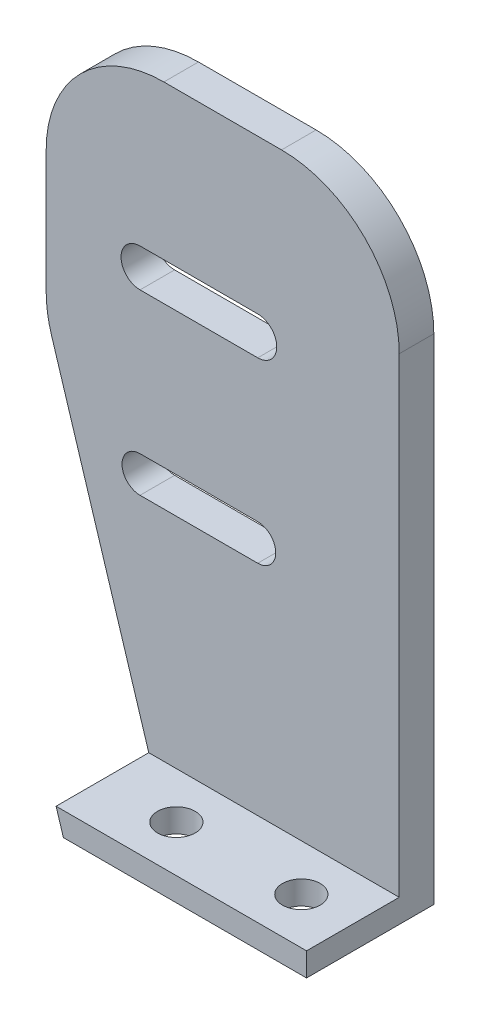
ISO-10303-21;
HEADER;
FILE_DESCRIPTION(('STEP AP214'),'2;1');
FILE_NAME('part.step','',(''),(''),'','','');
FILE_SCHEMA(('AUTOMOTIVE_DESIGN { 1 0 10303 214 1 1 1 1 }'));
ENDSEC;
DATA;
#1=APPLICATION_CONTEXT('core data for automotive mechanical design processes');
#2=APPLICATION_PROTOCOL_DEFINITION('international standard','automotive_design',2000,#1);
#3=PRODUCT_CONTEXT('',#1,'mechanical');
#4=PRODUCT('Part','Part','',(#3));
#5=PRODUCT_RELATED_PRODUCT_CATEGORY('part','',(#4));
#6=PRODUCT_DEFINITION_FORMATION('','',#4);
#7=PRODUCT_DEFINITION_CONTEXT('part definition',#1,'design');
#8=PRODUCT_DEFINITION('design','',#6,#7);
#9=PRODUCT_DEFINITION_SHAPE('','',#8);
#10=(LENGTH_UNIT() NAMED_UNIT(*) SI_UNIT(.MILLI.,.METRE.));
#11=(NAMED_UNIT(*) PLANE_ANGLE_UNIT() SI_UNIT($,.RADIAN.));
#12=(NAMED_UNIT(*) SI_UNIT($,.STERADIAN.) SOLID_ANGLE_UNIT());
#13=UNCERTAINTY_MEASURE_WITH_UNIT(LENGTH_MEASURE(1.E-05),#10,'distance_accuracy_value','');
#14=(GEOMETRIC_REPRESENTATION_CONTEXT(3) GLOBAL_UNCERTAINTY_ASSIGNED_CONTEXT((#13)) GLOBAL_UNIT_ASSIGNED_CONTEXT((#10,
#11,#12)) REPRESENTATION_CONTEXT('',''));
#15=CARTESIAN_POINT('',(0.,0.,0.));
#16=DIRECTION('',(0.,0.,1.));
#17=DIRECTION('',(1.,0.,0.));
#18=AXIS2_PLACEMENT_3D('',#15,#16,#17);
#19=CARTESIAN_POINT('',(15.,2.,-3.93700787401574));
#20=DIRECTION('',(-1.,0.,0.));
#21=DIRECTION('',(0.,0.,1.));
#22=AXIS2_PLACEMENT_3D('',#19,#20,#21);
#23=PLANE('',#22);
#24=DIRECTION('',(0.,-1.,0.));
#25=VECTOR('',#24,1.);
#26=CARTESIAN_POINT('',(15.,2.,-3.93700787401574));
#27=LINE('',#26,#25);
#28=CARTESIAN_POINT('',(15.,42.,-3.93700787401574));
#29=VERTEX_POINT('',#28);
#30=CARTESIAN_POINT('',(15.,0.,-3.93700787401574));
#31=VERTEX_POINT('',#30);
#32=EDGE_CURVE('E199',#29,#31,#27,.T.);
#33=ORIENTED_EDGE('',*,*,#32,.F.);
#34=DIRECTION('',(0.,0.,-1.));
#35=VECTOR('',#34,1.);
#36=CARTESIAN_POINT('',(15.,42.,-3.93700787401574));
#37=LINE('',#36,#35);
#38=CARTESIAN_POINT('',(15.,42.,-0.998677689997507));
#39=VERTEX_POINT('',#38);
#40=EDGE_CURVE('E11',#29,#39,#37,.F.);
#41=ORIENTED_EDGE('',*,*,#40,.T.);
#42=DIRECTION('',(0.,-1.,0.));
#43=VECTOR('',#42,1.);
#44=CARTESIAN_POINT('',(15.,52.,-0.998677689997507));
#45=LINE('',#44,#43);
#46=CARTESIAN_POINT('',(15.,2.,-0.998677689997507));
#47=VERTEX_POINT('',#46);
#48=EDGE_CURVE('E254',#39,#47,#45,.T.);
#49=ORIENTED_EDGE('',*,*,#48,.T.);
#50=DIRECTION('',(0.,0.,-1.));
#51=VECTOR('',#50,1.);
#52=CARTESIAN_POINT('',(15.,2.,-3.93700787401574));
#53=LINE('',#52,#51);
#54=CARTESIAN_POINT('',(15.,2.,6.87756826049224));
#55=VERTEX_POINT('',#54);
#56=EDGE_CURVE('E186',#55,#47,#53,.T.);
#57=ORIENTED_EDGE('',*,*,#56,.F.);
#58=DIRECTION('',(0.,-1.,0.));
#59=VECTOR('',#58,1.);
#60=CARTESIAN_POINT('',(15.,2.,6.87756826049224));
#61=LINE('',#60,#59);
#62=CARTESIAN_POINT('',(15.,0.,6.87756826049224));
#63=VERTEX_POINT('',#62);
#64=EDGE_CURVE('E194',#55,#63,#61,.T.);
#65=ORIENTED_EDGE('',*,*,#64,.T.);
#66=DIRECTION('',(0.,0.,-1.));
#67=VECTOR('',#66,1.);
#68=CARTESIAN_POINT('',(15.,0.,-3.93700787401574));
#69=LINE('',#68,#67);
#70=EDGE_CURVE('E185',#63,#31,#69,.T.);
#71=ORIENTED_EDGE('',*,*,#70,.T.);
#72=EDGE_LOOP('',(#33,#41,#49,#57,#65,#71));
#73=FACE_BOUND('',#72,.T.);
#74=ADVANCED_FACE('F33',(#73),#23,.F.);
#75=CARTESIAN_POINT('',(-15.,2.,-3.93700787401574));
#76=DIRECTION('',(0.,0.,1.));
#77=DIRECTION('',(1.,0.,0.));
#78=AXIS2_PLACEMENT_3D('',#75,#76,#77);
#79=PLANE('',#78);
#80=DIRECTION('',(-1.,0.,0.));
#81=VECTOR('',#80,1.);
#82=CARTESIAN_POINT('',(2.97561329115718,35.6877843306771,-3.93700787401574));
#83=LINE('',#82,#81);
#84=CARTESIAN_POINT('',(2.97561329115718,35.6877843306771,-3.93700787401574));
#85=VERTEX_POINT('',#84);
#86=CARTESIAN_POINT('',(-7.02438670884283,35.6877843306771,-3.93700787401574));
#87=VERTEX_POINT('',#86);
#88=EDGE_CURVE('E295',#85,#87,#83,.T.);
#89=ORIENTED_EDGE('',*,*,#88,.F.);
#90=CARTESIAN_POINT('',(2.97561329115718,37.3029416845353,-3.93700787401574));
#91=DIRECTION('',(0.,0.,-1.));
#92=DIRECTION('',(-1.,0.,0.));
#93=AXIS2_PLACEMENT_3D('',#90,#91,#92);
#94=CIRCLE('',#93,1.61515735385817);
#95=CARTESIAN_POINT('',(2.97561329115718,38.9180990383934,-3.93700787401574));
#96=VERTEX_POINT('',#95);
#97=EDGE_CURVE('E293',#96,#85,#94,.T.);
#98=ORIENTED_EDGE('',*,*,#97,.F.);
#99=DIRECTION('',(1.,0.,0.));
#100=VECTOR('',#99,1.);
#101=CARTESIAN_POINT('',(2.97561329115718,38.9180990383934,-3.93700787401574));
#102=LINE('',#101,#100);
#103=CARTESIAN_POINT('',(-7.02438670884283,38.9180990383934,-3.93700787401574));
#104=VERTEX_POINT('',#103);
#105=EDGE_CURVE('E302',#104,#96,#102,.T.);
#106=ORIENTED_EDGE('',*,*,#105,.F.);
#107=CARTESIAN_POINT('',(-7.02438670884283,37.3029416845353,-3.93700787401574));
#108=DIRECTION('',(0.,0.,-1.));
#109=DIRECTION('',(-1.,0.,0.));
#110=AXIS2_PLACEMENT_3D('',#107,#108,#109);
#111=CIRCLE('',#110,1.61515735385817);
#112=EDGE_CURVE('E299',#87,#104,#111,.T.);
#113=ORIENTED_EDGE('',*,*,#112,.F.);
#114=EDGE_LOOP('',(#89,#98,#106,#113));
#115=FACE_BOUND('',#114,.T.);
#116=DIRECTION('',(-1.,0.,0.));
#117=VECTOR('',#116,1.);
#118=CARTESIAN_POINT('',(2.97561329115761,20.5724514217065,-3.93700787401574));
#119=LINE('',#118,#117);
#120=CARTESIAN_POINT('',(2.97561329115761,20.5724514217065,-3.93700787401574));
#121=VERTEX_POINT('',#120);
#122=CARTESIAN_POINT('',(-7.02438670884242,20.5724514217065,-3.93700787401574));
#123=VERTEX_POINT('',#122);
#124=EDGE_CURVE('E314',#121,#123,#119,.T.);
#125=ORIENTED_EDGE('',*,*,#124,.F.);
#126=CARTESIAN_POINT('',(2.97561329115761,22.1029416845353,-3.93700787401574));
#127=DIRECTION('',(0.,0.,-1.));
#128=DIRECTION('',(-1.,0.,0.));
#129=AXIS2_PLACEMENT_3D('',#126,#127,#128);
#130=CIRCLE('',#129,1.53049026282878);
#131=CARTESIAN_POINT('',(2.97561329115761,23.6334319473641,-3.93700787401574));
#132=VERTEX_POINT('',#131);
#133=EDGE_CURVE('E288',#132,#121,#130,.T.);
#134=ORIENTED_EDGE('',*,*,#133,.F.);
#135=DIRECTION('',(1.,0.,0.));
#136=VECTOR('',#135,1.);
#137=CARTESIAN_POINT('',(2.97561329115761,23.6334319473641,-3.93700787401574));
#138=LINE('',#137,#136);
#139=CARTESIAN_POINT('',(-7.02438670884242,23.6334319473641,-3.93700787401574));
#140=VERTEX_POINT('',#139);
#141=EDGE_CURVE('E320',#140,#132,#138,.T.);
#142=ORIENTED_EDGE('',*,*,#141,.F.);
#143=CARTESIAN_POINT('',(-7.02438670884242,22.1029416845353,-3.93700787401574));
#144=DIRECTION('',(0.,0.,-1.));
#145=DIRECTION('',(-1.,0.,0.));
#146=AXIS2_PLACEMENT_3D('',#143,#144,#145);
#147=CIRCLE('',#146,1.53049026282878);
#148=EDGE_CURVE('E317',#123,#140,#147,.T.);
#149=ORIENTED_EDGE('',*,*,#148,.F.);
#150=EDGE_LOOP('',(#125,#134,#142,#149));
#151=FACE_BOUND('',#150,.T.);
#152=DIRECTION('',(0.296868908058511,-0.954918243321462,0.));
#153=VECTOR('',#152,1.);
#154=CARTESIAN_POINT('',(-4.08092302934193,-5.08085043264828,-3.93700787401574));
#155=LINE('',#154,#153);
#156=CARTESIAN_POINT('',(-14.5491824332147,28.5916952911675,-3.93700787401574));
#157=VERTEX_POINT('',#156);
#158=CARTESIAN_POINT('',(-5.66047869339802,0.,-3.93700787401574));
#159=VERTEX_POINT('',#158);
#160=EDGE_CURVE('E167',#157,#159,#155,.T.);
#161=ORIENTED_EDGE('',*,*,#160,.F.);
#162=CARTESIAN_POINT('',(-5.,31.5603843717527,-3.93700787401574));
#163=DIRECTION('',(0.,0.,1.));
#164=DIRECTION('',(1.,0.,0.));
#165=AXIS2_PLACEMENT_3D('',#162,#163,#164);
#166=CIRCLE('',#165,10.);
#167=CARTESIAN_POINT('',(-15.,31.5603843717527,-3.93700787401574));
#168=VERTEX_POINT('',#167);
#169=EDGE_CURVE('E231',#157,#168,#166,.F.);
#170=ORIENTED_EDGE('',*,*,#169,.T.);
#171=DIRECTION('',(0.,-1.,0.));
#172=VECTOR('',#171,1.);
#173=CARTESIAN_POINT('',(-15.,2.,-3.93700787401574));
#174=LINE('',#173,#172);
#175=CARTESIAN_POINT('',(-15.,42.,-3.93700787401574));
#176=VERTEX_POINT('',#175);
#177=EDGE_CURVE('E196',#176,#168,#174,.T.);
#178=ORIENTED_EDGE('',*,*,#177,.F.);
#179=CARTESIAN_POINT('',(-5.,42.,-3.93700787401574));
#180=DIRECTION('',(0.,0.,1.));
#181=DIRECTION('',(1.,0.,0.));
#182=AXIS2_PLACEMENT_3D('',#179,#180,#181);
#183=CIRCLE('',#182,10.);
#184=CARTESIAN_POINT('',(-5.,52.,-3.93700787401574));
#185=VERTEX_POINT('',#184);
#186=EDGE_CURVE('E229',#176,#185,#183,.F.);
#187=ORIENTED_EDGE('',*,*,#186,.T.);
#188=DIRECTION('',(-1.,0.,0.));
#189=VECTOR('',#188,1.);
#190=CARTESIAN_POINT('',(15.,52.,-3.93700787401574));
#191=LINE('',#190,#189);
#192=CARTESIAN_POINT('',(5.00000000000001,52.,-3.93700787401574));
#193=VERTEX_POINT('',#192);
#194=EDGE_CURVE('E249',#193,#185,#191,.T.);
#195=ORIENTED_EDGE('',*,*,#194,.F.);
#196=CARTESIAN_POINT('',(5.00000000000001,42.,-3.93700787401574));
#197=DIRECTION('',(0.,0.,1.));
#198=DIRECTION('',(1.,0.,0.));
#199=AXIS2_PLACEMENT_3D('',#196,#197,#198);
#200=CIRCLE('',#199,10.);
#201=EDGE_CURVE('E227',#193,#29,#200,.F.);
#202=ORIENTED_EDGE('',*,*,#201,.T.);
#203=ORIENTED_EDGE('',*,*,#32,.T.);
#204=DIRECTION('',(-1.,0.,0.));
#205=VECTOR('',#204,1.);
#206=CARTESIAN_POINT('',(-15.,0.,-3.93700787401574));
#207=LINE('',#206,#205);
#208=EDGE_CURVE('E187',#31,#159,#207,.T.);
#209=ORIENTED_EDGE('',*,*,#208,.T.);
#210=EDGE_LOOP('',(#161,#170,#178,#187,#195,#202,#203,#209));
#211=FACE_BOUND('',#210,.T.);
#212=ADVANCED_FACE('F337',(#115,#151,#211),#79,.F.);
#213=CARTESIAN_POINT('',(-15.,2.,-3.93700787401574));
#214=DIRECTION('',(1.,0.,0.));
#215=DIRECTION('',(0.,0.,-1.));
#216=AXIS2_PLACEMENT_3D('',#213,#214,#215);
#217=PLANE('',#216);
#218=ORIENTED_EDGE('',*,*,#177,.T.);
#219=DIRECTION('',(0.,0.,-1.));
#220=VECTOR('',#219,1.);
#221=CARTESIAN_POINT('',(-15.,31.5603843717527,-3.93700787401574));
#222=LINE('',#221,#220);
#223=CARTESIAN_POINT('',(-15.,31.5603843717527,-0.998677689997507));
#224=VERTEX_POINT('',#223);
#225=EDGE_CURVE('E235',#168,#224,#222,.F.);
#226=ORIENTED_EDGE('',*,*,#225,.T.);
#227=DIRECTION('',(0.,-1.,0.));
#228=VECTOR('',#227,1.);
#229=CARTESIAN_POINT('',(-15.,52.,-0.998677689997507));
#230=LINE('',#229,#228);
#231=CARTESIAN_POINT('',(-15.,42.,-0.998677689997507));
#232=VERTEX_POINT('',#231);
#233=EDGE_CURVE('E256',#232,#224,#230,.T.);
#234=ORIENTED_EDGE('',*,*,#233,.F.);
#235=DIRECTION('',(0.,0.,1.));
#236=VECTOR('',#235,1.);
#237=CARTESIAN_POINT('',(-15.,42.,-3.93700787401574));
#238=LINE('',#237,#236);
#239=EDGE_CURVE('E233',#232,#176,#238,.F.);
#240=ORIENTED_EDGE('',*,*,#239,.T.);
#241=EDGE_LOOP('',(#218,#226,#234,#240));
#242=FACE_BOUND('',#241,.T.);
#243=ADVANCED_FACE('F363',(#242),#217,.F.);
#244=CARTESIAN_POINT('',(-15.,2.,6.87756826049224));
#245=DIRECTION('',(0.,0.,-1.));
#246=DIRECTION('',(-1.,0.,0.));
#247=AXIS2_PLACEMENT_3D('',#244,#245,#246);
#248=PLANE('',#247);
#249=DIRECTION('',(1.,0.,0.));
#250=VECTOR('',#249,1.);
#251=CARTESIAN_POINT('',(-15.,2.,6.87756826049224));
#252=LINE('',#251,#250);
#253=CARTESIAN_POINT('',(-6.28224691310639,2.,6.87756826049224));
#254=VERTEX_POINT('',#253);
#255=EDGE_CURVE('E180',#254,#55,#252,.T.);
#256=ORIENTED_EDGE('',*,*,#255,.F.);
#257=DIRECTION('',(0.296868908058511,-0.954918243321462,0.));
#258=VECTOR('',#257,1.);
#259=CARTESIAN_POINT('',(-4.08092302934193,-5.08085043264828,6.87756826049224));
#260=LINE('',#259,#258);
#261=CARTESIAN_POINT('',(-5.66047869339802,0.,6.87756826049224));
#262=VERTEX_POINT('',#261);
#263=EDGE_CURVE('E163',#254,#262,#260,.T.);
#264=ORIENTED_EDGE('',*,*,#263,.T.);
#265=DIRECTION('',(1.,0.,0.));
#266=VECTOR('',#265,1.);
#267=CARTESIAN_POINT('',(-15.,0.,6.87756826049224));
#268=LINE('',#267,#266);
#269=EDGE_CURVE('E178',#262,#63,#268,.T.);
#270=ORIENTED_EDGE('',*,*,#269,.T.);
#271=ORIENTED_EDGE('',*,*,#64,.F.);
#272=EDGE_LOOP('',(#256,#264,#270,#271));
#273=FACE_BOUND('',#272,.T.);
#274=ADVANCED_FACE('F176',(#273),#248,.F.);
#275=CARTESIAN_POINT('',(0.,2.,0.));
#276=DIRECTION('',(0.,1.,0.));
#277=DIRECTION('',(0.,0.,1.));
#278=AXIS2_PLACEMENT_3D('',#275,#276,#277);
#279=PLANE('',#278);
#280=DIRECTION('',(0.,0.,1.));
#281=VECTOR('',#280,1.);
#282=CARTESIAN_POINT('',(-6.28224691310639,2.,-3.93800787401577));
#283=LINE('',#282,#281);
#284=CARTESIAN_POINT('',(-6.28224691310639,2.,-0.998677689997507));
#285=VERTEX_POINT('',#284);
#286=EDGE_CURVE('E172',#285,#254,#283,.T.);
#287=ORIENTED_EDGE('',*,*,#286,.T.);
#288=ORIENTED_EDGE('',*,*,#255,.T.);
#289=ORIENTED_EDGE('',*,*,#56,.T.);
#290=DIRECTION('',(1.,0.,0.));
#291=VECTOR('',#290,1.);
#292=CARTESIAN_POINT('',(15.,2.,-0.998677689997507));
#293=LINE('',#292,#291);
#294=EDGE_CURVE('E258',#285,#47,#293,.T.);
#295=ORIENTED_EDGE('',*,*,#294,.F.);
#296=EDGE_LOOP('',(#287,#288,#289,#295));
#297=FACE_BOUND('',#296,.T.);
#298=CARTESIAN_POINT('',(10.6189373895771,2.,2.93944528524737));
#299=DIRECTION('',(0.,1.,0.));
#300=DIRECTION('',(0.,0.,1.));
#301=AXIS2_PLACEMENT_3D('',#298,#299,#300);
#302=CIRCLE('',#301,1.6);
#303=CARTESIAN_POINT('',(10.6189373895771,2.,4.53944528524737));
#304=VERTEX_POINT('',#303);
#305=EDGE_CURVE('E281',#304,#304,#302,.T.);
#306=ORIENTED_EDGE('',*,*,#305,.F.);
#307=EDGE_LOOP('',(#306));
#308=FACE_BOUND('',#307,.T.);
#309=CARTESIAN_POINT('',(0.,2.,2.93944528524737));
#310=DIRECTION('',(0.,1.,0.));
#311=DIRECTION('',(0.,0.,1.));
#312=AXIS2_PLACEMENT_3D('',#309,#310,#311);
#313=CIRCLE('',#312,1.6);
#314=CARTESIAN_POINT('',(0.,2.,4.53944528524737));
#315=VERTEX_POINT('',#314);
#316=EDGE_CURVE('E280',#315,#315,#313,.T.);
#317=ORIENTED_EDGE('',*,*,#316,.F.);
#318=EDGE_LOOP('',(#317));
#319=FACE_BOUND('',#318,.T.);
#320=ADVANCED_FACE('F272',(#297,#308,#319),#279,.T.);
#321=CARTESIAN_POINT('',(0.,0.,0.));
#322=DIRECTION('',(0.,1.,0.));
#323=DIRECTION('',(0.,0.,1.));
#324=AXIS2_PLACEMENT_3D('',#321,#322,#323);
#325=PLANE('',#324);
#326=CARTESIAN_POINT('',(10.6189373895771,0.,2.93944528524737));
#327=DIRECTION('',(0.,1.,0.));
#328=DIRECTION('',(0.,0.,1.));
#329=AXIS2_PLACEMENT_3D('',#326,#327,#328);
#330=CIRCLE('',#329,1.6);
#331=CARTESIAN_POINT('',(10.6189373895771,0.,4.53944528524737));
#332=VERTEX_POINT('',#331);
#333=EDGE_CURVE('E284',#332,#332,#330,.F.);
#334=ORIENTED_EDGE('',*,*,#333,.F.);
#335=EDGE_LOOP('',(#334));
#336=FACE_BOUND('',#335,.T.);
#337=CARTESIAN_POINT('',(0.,0.,2.93944528524737));
#338=DIRECTION('',(0.,1.,0.));
#339=DIRECTION('',(0.,0.,1.));
#340=AXIS2_PLACEMENT_3D('',#337,#338,#339);
#341=CIRCLE('',#340,1.6);
#342=CARTESIAN_POINT('',(0.,0.,4.53944528524737));
#343=VERTEX_POINT('',#342);
#344=EDGE_CURVE('E285',#343,#343,#341,.F.);
#345=ORIENTED_EDGE('',*,*,#344,.F.);
#346=EDGE_LOOP('',(#345));
#347=FACE_BOUND('',#346,.T.);
#348=ORIENTED_EDGE('',*,*,#269,.F.);
#349=DIRECTION('',(0.,0.,1.));
#350=VECTOR('',#349,1.);
#351=CARTESIAN_POINT('',(-5.66047869339802,0.,-3.93800787401577));
#352=LINE('',#351,#350);
#353=EDGE_CURVE('E159',#159,#262,#352,.T.);
#354=ORIENTED_EDGE('',*,*,#353,.F.);
#355=ORIENTED_EDGE('',*,*,#208,.F.);
#356=ORIENTED_EDGE('',*,*,#70,.F.);
#357=EDGE_LOOP('',(#348,#354,#355,#356));
#358=FACE_BOUND('',#357,.T.);
#359=ADVANCED_FACE('F183',(#336,#347,#358),#325,.F.);
#360=CARTESIAN_POINT('',(15.,52.,-0.998677689997507));
#361=DIRECTION('',(0.,0.,-1.));
#362=DIRECTION('',(-1.,0.,0.));
#363=AXIS2_PLACEMENT_3D('',#360,#361,#362);
#364=PLANE('',#363);
#365=DIRECTION('',(1.,0.,0.));
#366=VECTOR('',#365,1.);
#367=CARTESIAN_POINT('',(15.,38.9180990383934,-0.998677689997507));
#368=LINE('',#367,#366);
#369=CARTESIAN_POINT('',(-7.02438670884283,38.9180990383934,-0.998677689997507));
#370=VERTEX_POINT('',#369);
#371=CARTESIAN_POINT('',(2.97561329115717,38.9180990383934,-0.998677689997507));
#372=VERTEX_POINT('',#371);
#373=EDGE_CURVE('E219',#370,#372,#368,.T.);
#374=ORIENTED_EDGE('',*,*,#373,.T.);
#375=CARTESIAN_POINT('',(2.97561329115717,37.3029416845353,-0.998677689997507));
#376=DIRECTION('',(0.,0.,-1.));
#377=DIRECTION('',(-1.,0.,0.));
#378=AXIS2_PLACEMENT_3D('',#375,#376,#377);
#379=CIRCLE('',#378,1.61515735385817);
#380=CARTESIAN_POINT('',(2.97561329115717,35.6877843306771,-0.998677689997507));
#381=VERTEX_POINT('',#380);
#382=EDGE_CURVE('E222',#372,#381,#379,.T.);
#383=ORIENTED_EDGE('',*,*,#382,.T.);
#384=DIRECTION('',(-1.,0.,0.));
#385=VECTOR('',#384,1.);
#386=CARTESIAN_POINT('',(15.,35.6877843306771,-0.998677689997507));
#387=LINE('',#386,#385);
#388=CARTESIAN_POINT('',(-7.02438670884283,35.6877843306771,-0.998677689997507));
#389=VERTEX_POINT('',#388);
#390=EDGE_CURVE('E213',#381,#389,#387,.T.);
#391=ORIENTED_EDGE('',*,*,#390,.T.);
#392=CARTESIAN_POINT('',(-7.02438670884283,37.3029416845353,-0.998677689997507));
#393=DIRECTION('',(0.,0.,-1.));
#394=DIRECTION('',(-1.,0.,0.));
#395=AXIS2_PLACEMENT_3D('',#392,#393,#394);
#396=CIRCLE('',#395,1.61515735385817);
#397=EDGE_CURVE('E216',#389,#370,#396,.T.);
#398=ORIENTED_EDGE('',*,*,#397,.T.);
#399=EDGE_LOOP('',(#374,#383,#391,#398));
#400=FACE_BOUND('',#399,.T.);
#401=DIRECTION('',(1.,0.,0.));
#402=VECTOR('',#401,1.);
#403=CARTESIAN_POINT('',(15.,23.6334319473641,-0.998677689997507));
#404=LINE('',#403,#402);
#405=CARTESIAN_POINT('',(-7.02438670884242,23.6334319473641,-0.998677689997507));
#406=VERTEX_POINT('',#405);
#407=CARTESIAN_POINT('',(2.9756132911576,23.6334319473641,-0.998677689997507));
#408=VERTEX_POINT('',#407);
#409=EDGE_CURVE('E207',#406,#408,#404,.T.);
#410=ORIENTED_EDGE('',*,*,#409,.T.);
#411=CARTESIAN_POINT('',(2.9756132911576,22.1029416845353,-0.998677689997507));
#412=DIRECTION('',(0.,0.,-1.));
#413=DIRECTION('',(-1.,0.,0.));
#414=AXIS2_PLACEMENT_3D('',#411,#412,#413);
#415=CIRCLE('',#414,1.53049026282878);
#416=CARTESIAN_POINT('',(2.9756132911576,20.5724514217065,-0.998677689997507));
#417=VERTEX_POINT('',#416);
#418=EDGE_CURVE('E210',#408,#417,#415,.T.);
#419=ORIENTED_EDGE('',*,*,#418,.T.);
#420=DIRECTION('',(-1.,0.,0.));
#421=VECTOR('',#420,1.);
#422=CARTESIAN_POINT('',(15.,20.5724514217065,-0.998677689997507));
#423=LINE('',#422,#421);
#424=CARTESIAN_POINT('',(-7.02438670884241,20.5724514217065,-0.998677689997507));
#425=VERTEX_POINT('',#424);
#426=EDGE_CURVE('E201',#417,#425,#423,.T.);
#427=ORIENTED_EDGE('',*,*,#426,.T.);
#428=CARTESIAN_POINT('',(-7.02438670884242,22.1029416845353,-0.998677689997507));
#429=DIRECTION('',(0.,0.,-1.));
#430=DIRECTION('',(-1.,0.,0.));
#431=AXIS2_PLACEMENT_3D('',#428,#429,#430);
#432=CIRCLE('',#431,1.53049026282878);
#433=EDGE_CURVE('E204',#425,#406,#432,.T.);
#434=ORIENTED_EDGE('',*,*,#433,.T.);
#435=EDGE_LOOP('',(#410,#419,#427,#434));
#436=FACE_BOUND('',#435,.T.);
#437=ORIENTED_EDGE('',*,*,#233,.T.);
#438=CARTESIAN_POINT('',(-5.,31.5603843717527,-0.998677689997507));
#439=DIRECTION('',(0.,0.,-1.));
#440=DIRECTION('',(-1.,0.,0.));
#441=AXIS2_PLACEMENT_3D('',#438,#439,#440);
#442=CIRCLE('',#441,10.);
#443=CARTESIAN_POINT('',(-14.5491824332147,28.5916952911675,-0.998677689997507));
#444=VERTEX_POINT('',#443);
#445=EDGE_CURVE('E239',#224,#444,#442,.F.);
#446=ORIENTED_EDGE('',*,*,#445,.T.);
#447=DIRECTION('',(-0.296868908058511,0.954918243321462,0.));
#448=VECTOR('',#447,1.);
#449=CARTESIAN_POINT('',(-4.08092302934193,-5.08085043264828,-0.998677689997507));
#450=LINE('',#449,#448);
#451=EDGE_CURVE('E275',#285,#444,#450,.T.);
#452=ORIENTED_EDGE('',*,*,#451,.F.);
#453=ORIENTED_EDGE('',*,*,#294,.T.);
#454=ORIENTED_EDGE('',*,*,#48,.F.);
#455=CARTESIAN_POINT('',(5.,42.,-0.998677689997507));
#456=DIRECTION('',(0.,0.,-1.));
#457=DIRECTION('',(-1.,0.,0.));
#458=AXIS2_PLACEMENT_3D('',#455,#456,#457);
#459=CIRCLE('',#458,10.);
#460=CARTESIAN_POINT('',(5.,52.,-0.998677689997507));
#461=VERTEX_POINT('',#460);
#462=EDGE_CURVE('E48',#39,#461,#459,.F.);
#463=ORIENTED_EDGE('',*,*,#462,.T.);
#464=DIRECTION('',(1.,0.,0.));
#465=VECTOR('',#464,1.);
#466=CARTESIAN_POINT('',(15.,52.,-0.998677689997507));
#467=LINE('',#466,#465);
#468=CARTESIAN_POINT('',(-5.,52.,-0.998677689997507));
#469=VERTEX_POINT('',#468);
#470=EDGE_CURVE('E246',#469,#461,#467,.T.);
#471=ORIENTED_EDGE('',*,*,#470,.F.);
#472=CARTESIAN_POINT('',(-5.,42.,-0.998677689997507));
#473=DIRECTION('',(0.,0.,-1.));
#474=DIRECTION('',(-1.,0.,0.));
#475=AXIS2_PLACEMENT_3D('',#472,#473,#474);
#476=CIRCLE('',#475,10.);
#477=EDGE_CURVE('E56',#469,#232,#476,.F.);
#478=ORIENTED_EDGE('',*,*,#477,.T.);
#479=EDGE_LOOP('',(#437,#446,#452,#453,#454,#463,#471,#478));
#480=FACE_BOUND('',#479,.T.);
#481=ADVANCED_FACE('F252',(#400,#436,#480),#364,.F.);
#482=CARTESIAN_POINT('',(0.,52.,0.));
#483=DIRECTION('',(0.,-1.,0.));
#484=DIRECTION('',(0.,0.,-1.));
#485=AXIS2_PLACEMENT_3D('',#482,#483,#484);
#486=PLANE('',#485);
#487=ORIENTED_EDGE('',*,*,#194,.T.);
#488=DIRECTION('',(0.,0.,1.));
#489=VECTOR('',#488,1.);
#490=CARTESIAN_POINT('',(-5.,52.,0.));
#491=LINE('',#490,#489);
#492=EDGE_CURVE('E41',#185,#469,#491,.T.);
#493=ORIENTED_EDGE('',*,*,#492,.T.);
#494=ORIENTED_EDGE('',*,*,#470,.T.);
#495=DIRECTION('',(0.,0.,-1.));
#496=VECTOR('',#495,1.);
#497=CARTESIAN_POINT('',(5.,52.,0.));
#498=LINE('',#497,#496);
#499=EDGE_CURVE('E241',#461,#193,#498,.T.);
#500=ORIENTED_EDGE('',*,*,#499,.T.);
#501=EDGE_LOOP('',(#487,#493,#494,#500));
#502=FACE_BOUND('',#501,.T.);
#503=ADVANCED_FACE('F245',(#502),#486,.F.);
#504=CARTESIAN_POINT('',(2.97561329115761,22.1029416845353,6.87756826049224));
#505=DIRECTION('',(0.,0.,-1.));
#506=DIRECTION('',(-1.,0.,0.));
#507=AXIS2_PLACEMENT_3D('',#504,#505,#506);
#508=CYLINDRICAL_SURFACE('',#507,1.53049026282878);
#509=DIRECTION('',(0.,0.,-1.));
#510=VECTOR('',#509,1.);
#511=CARTESIAN_POINT('',(2.97561329115761,23.6334319473641,6.87756826049224));
#512=LINE('',#511,#510);
#513=EDGE_CURVE('E296',#408,#132,#512,.T.);
#514=ORIENTED_EDGE('',*,*,#513,.T.);
#515=ORIENTED_EDGE('',*,*,#133,.T.);
#516=DIRECTION('',(0.,0.,-1.));
#517=VECTOR('',#516,1.);
#518=CARTESIAN_POINT('',(2.97561329115761,20.5724514217065,6.87756826049224));
#519=LINE('',#518,#517);
#520=EDGE_CURVE('E323',#417,#121,#519,.T.);
#521=ORIENTED_EDGE('',*,*,#520,.F.);
#522=ORIENTED_EDGE('',*,*,#418,.F.);
#523=EDGE_LOOP('',(#514,#515,#521,#522));
#524=FACE_BOUND('',#523,.T.);
#525=ADVANCED_FACE('F346',(#524),#508,.F.);
#526=CARTESIAN_POINT('',(2.97561329115761,23.6334319473641,6.87756826049224));
#527=DIRECTION('',(0.,1.,0.));
#528=DIRECTION('',(-1.,0.,0.));
#529=AXIS2_PLACEMENT_3D('',#526,#527,#528);
#530=PLANE('',#529);
#531=DIRECTION('',(0.,0.,-1.));
#532=VECTOR('',#531,1.);
#533=CARTESIAN_POINT('',(-7.02438670884241,23.6334319473641,6.87756826049224));
#534=LINE('',#533,#532);
#535=EDGE_CURVE('E325',#406,#140,#534,.T.);
#536=ORIENTED_EDGE('',*,*,#535,.T.);
#537=ORIENTED_EDGE('',*,*,#141,.T.);
#538=ORIENTED_EDGE('',*,*,#513,.F.);
#539=ORIENTED_EDGE('',*,*,#409,.F.);
#540=EDGE_LOOP('',(#536,#537,#538,#539));
#541=FACE_BOUND('',#540,.T.);
#542=ADVANCED_FACE('F348',(#541),#530,.F.);
#543=CARTESIAN_POINT('',(-7.02438670884241,22.1029416845353,6.87756826049224));
#544=DIRECTION('',(0.,0.,-1.));
#545=DIRECTION('',(-1.,0.,0.));
#546=AXIS2_PLACEMENT_3D('',#543,#544,#545);
#547=CYLINDRICAL_SURFACE('',#546,1.53049026282878);
#548=DIRECTION('',(0.,0.,-1.));
#549=VECTOR('',#548,1.);
#550=CARTESIAN_POINT('',(-7.02438670884241,20.5724514217065,6.87756826049224));
#551=LINE('',#550,#549);
#552=EDGE_CURVE('E327',#425,#123,#551,.T.);
#553=ORIENTED_EDGE('',*,*,#552,.T.);
#554=ORIENTED_EDGE('',*,*,#148,.T.);
#555=ORIENTED_EDGE('',*,*,#535,.F.);
#556=ORIENTED_EDGE('',*,*,#433,.F.);
#557=EDGE_LOOP('',(#553,#554,#555,#556));
#558=FACE_BOUND('',#557,.T.);
#559=ADVANCED_FACE('F342',(#558),#547,.F.);
#560=CARTESIAN_POINT('',(2.97561329115761,20.5724514217065,6.87756826049224));
#561=DIRECTION('',(0.,-1.,0.));
#562=DIRECTION('',(1.,0.,0.));
#563=AXIS2_PLACEMENT_3D('',#560,#561,#562);
#564=PLANE('',#563);
#565=ORIENTED_EDGE('',*,*,#520,.T.);
#566=ORIENTED_EDGE('',*,*,#124,.T.);
#567=ORIENTED_EDGE('',*,*,#552,.F.);
#568=ORIENTED_EDGE('',*,*,#426,.F.);
#569=EDGE_LOOP('',(#565,#566,#567,#568));
#570=FACE_BOUND('',#569,.T.);
#571=ADVANCED_FACE('F332',(#570),#564,.F.);
#572=CARTESIAN_POINT('',(2.97561329115718,37.3029416845353,6.87756826049224));
#573=DIRECTION('',(0.,0.,-1.));
#574=DIRECTION('',(-1.,0.,0.));
#575=AXIS2_PLACEMENT_3D('',#572,#573,#574);
#576=CYLINDRICAL_SURFACE('',#575,1.61515735385817);
#577=DIRECTION('',(0.,0.,-1.));
#578=VECTOR('',#577,1.);
#579=CARTESIAN_POINT('',(2.97561329115718,38.9180990383934,6.87756826049224));
#580=LINE('',#579,#578);
#581=EDGE_CURVE('E263',#372,#96,#580,.T.);
#582=ORIENTED_EDGE('',*,*,#581,.T.);
#583=ORIENTED_EDGE('',*,*,#97,.T.);
#584=DIRECTION('',(0.,0.,-1.));
#585=VECTOR('',#584,1.);
#586=CARTESIAN_POINT('',(2.97561329115718,35.6877843306771,6.87756826049224));
#587=LINE('',#586,#585);
#588=EDGE_CURVE('E305',#381,#85,#587,.T.);
#589=ORIENTED_EDGE('',*,*,#588,.F.);
#590=ORIENTED_EDGE('',*,*,#382,.F.);
#591=EDGE_LOOP('',(#582,#583,#589,#590));
#592=FACE_BOUND('',#591,.T.);
#593=ADVANCED_FACE('F399',(#592),#576,.F.);
#594=CARTESIAN_POINT('',(2.97561329115718,38.9180990383934,6.87756826049224));
#595=DIRECTION('',(0.,1.,0.));
#596=DIRECTION('',(0.,0.,1.));
#597=AXIS2_PLACEMENT_3D('',#594,#595,#596);
#598=PLANE('',#597);
#599=DIRECTION('',(0.,0.,-1.));
#600=VECTOR('',#599,1.);
#601=CARTESIAN_POINT('',(-7.02438670884283,38.9180990383934,6.87756826049224));
#602=LINE('',#601,#600);
#603=EDGE_CURVE('E307',#370,#104,#602,.T.);
#604=ORIENTED_EDGE('',*,*,#603,.T.);
#605=ORIENTED_EDGE('',*,*,#105,.T.);
#606=ORIENTED_EDGE('',*,*,#581,.F.);
#607=ORIENTED_EDGE('',*,*,#373,.F.);
#608=EDGE_LOOP('',(#604,#605,#606,#607));
#609=FACE_BOUND('',#608,.T.);
#610=ADVANCED_FACE('F403',(#609),#598,.F.);
#611=CARTESIAN_POINT('',(-7.02438670884283,37.3029416845353,6.87756826049224));
#612=DIRECTION('',(0.,0.,-1.));
#613=DIRECTION('',(-1.,0.,0.));
#614=AXIS2_PLACEMENT_3D('',#611,#612,#613);
#615=CYLINDRICAL_SURFACE('',#614,1.61515735385817);
#616=DIRECTION('',(0.,0.,-1.));
#617=VECTOR('',#616,1.);
#618=CARTESIAN_POINT('',(-7.02438670884283,35.6877843306771,6.87756826049224));
#619=LINE('',#618,#617);
#620=EDGE_CURVE('E309',#389,#87,#619,.T.);
#621=ORIENTED_EDGE('',*,*,#620,.T.);
#622=ORIENTED_EDGE('',*,*,#112,.T.);
#623=ORIENTED_EDGE('',*,*,#603,.F.);
#624=ORIENTED_EDGE('',*,*,#397,.F.);
#625=EDGE_LOOP('',(#621,#622,#623,#624));
#626=FACE_BOUND('',#625,.T.);
#627=ADVANCED_FACE('F408',(#626),#615,.F.);
#628=CARTESIAN_POINT('',(2.97561329115718,35.6877843306771,6.87756826049224));
#629=DIRECTION('',(0.,-1.,0.));
#630=DIRECTION('',(0.,0.,-1.));
#631=AXIS2_PLACEMENT_3D('',#628,#629,#630);
#632=PLANE('',#631);
#633=ORIENTED_EDGE('',*,*,#588,.T.);
#634=ORIENTED_EDGE('',*,*,#88,.T.);
#635=ORIENTED_EDGE('',*,*,#620,.F.);
#636=ORIENTED_EDGE('',*,*,#390,.F.);
#637=EDGE_LOOP('',(#633,#634,#635,#636));
#638=FACE_BOUND('',#637,.T.);
#639=ADVANCED_FACE('F412',(#638),#632,.F.);
#640=CARTESIAN_POINT('',(0.,-0.000999999999973245,2.93944528524737));
#641=DIRECTION('',(0.,1.,0.));
#642=DIRECTION('',(0.,0.,1.));
#643=AXIS2_PLACEMENT_3D('',#640,#641,#642);
#644=CYLINDRICAL_SURFACE('',#643,1.6);
#645=ORIENTED_EDGE('',*,*,#316,.T.);
#646=EDGE_LOOP('',(#645));
#647=FACE_BOUND('',#646,.T.);
#648=ORIENTED_EDGE('',*,*,#344,.T.);
#649=EDGE_LOOP('',(#648));
#650=FACE_BOUND('',#649,.T.);
#651=ADVANCED_FACE('F415',(#647,#650),#644,.F.);
#652=CARTESIAN_POINT('',(10.6189373895771,-0.000999999999973245,2.93944528524737));
#653=DIRECTION('',(0.,1.,0.));
#654=DIRECTION('',(0.,0.,1.));
#655=AXIS2_PLACEMENT_3D('',#652,#653,#654);
#656=CYLINDRICAL_SURFACE('',#655,1.6);
#657=ORIENTED_EDGE('',*,*,#305,.T.);
#658=EDGE_LOOP('',(#657));
#659=FACE_BOUND('',#658,.T.);
#660=ORIENTED_EDGE('',*,*,#333,.T.);
#661=EDGE_LOOP('',(#660));
#662=FACE_BOUND('',#661,.T.);
#663=ADVANCED_FACE('F422',(#659,#662),#656,.F.);
#664=CARTESIAN_POINT('',(-4.08092302934193,-5.08085043264828,-3.93800787401577));
#665=DIRECTION('',(0.954918243321464,0.296868908058511,0.));
#666=DIRECTION('',(-0.296868908058511,0.954918243321462,0.));
#667=AXIS2_PLACEMENT_3D('',#664,#665,#666);
#668=PLANE('',#667);
#669=ORIENTED_EDGE('',*,*,#451,.T.);
#670=DIRECTION('',(0.,0.,-1.));
#671=VECTOR('',#670,1.);
#672=CARTESIAN_POINT('',(-14.5491824332147,28.5916952911675,-3.93800787401577));
#673=LINE('',#672,#671);
#674=EDGE_CURVE('E225',#444,#157,#673,.T.);
#675=ORIENTED_EDGE('',*,*,#674,.T.);
#676=ORIENTED_EDGE('',*,*,#160,.T.);
#677=ORIENTED_EDGE('',*,*,#353,.T.);
#678=ORIENTED_EDGE('',*,*,#263,.F.);
#679=ORIENTED_EDGE('',*,*,#286,.F.);
#680=EDGE_LOOP('',(#669,#675,#676,#677,#678,#679));
#681=FACE_BOUND('',#680,.T.);
#682=ADVANCED_FACE('F162',(#681),#668,.F.);
#683=CARTESIAN_POINT('',(-5.,31.5603843717527,-3.93800787401577));
#684=DIRECTION('',(0.,0.,-1.));
#685=DIRECTION('',(-1.,0.,0.));
#686=AXIS2_PLACEMENT_3D('',#683,#684,#685);
#687=CYLINDRICAL_SURFACE('',#686,10.);
#688=ORIENTED_EDGE('',*,*,#445,.F.);
#689=ORIENTED_EDGE('',*,*,#225,.F.);
#690=ORIENTED_EDGE('',*,*,#169,.F.);
#691=ORIENTED_EDGE('',*,*,#674,.F.);
#692=EDGE_LOOP('',(#688,#689,#690,#691));
#693=FACE_BOUND('',#692,.T.);
#694=ADVANCED_FACE('F368',(#693),#687,.T.);
#695=CARTESIAN_POINT('',(-5.,42.,0.));
#696=DIRECTION('',(0.,0.,1.));
#697=DIRECTION('',(1.,0.,0.));
#698=AXIS2_PLACEMENT_3D('',#695,#696,#697);
#699=CYLINDRICAL_SURFACE('',#698,10.);
#700=ORIENTED_EDGE('',*,*,#186,.F.);
#701=ORIENTED_EDGE('',*,*,#239,.F.);
#702=ORIENTED_EDGE('',*,*,#477,.F.);
#703=ORIENTED_EDGE('',*,*,#492,.F.);
#704=EDGE_LOOP('',(#700,#701,#702,#703));
#705=FACE_BOUND('',#704,.T.);
#706=ADVANCED_FACE('F370',(#705),#699,.T.);
#707=CARTESIAN_POINT('',(5.,42.,0.));
#708=DIRECTION('',(0.,0.,-1.));
#709=DIRECTION('',(-1.,0.,0.));
#710=AXIS2_PLACEMENT_3D('',#707,#708,#709);
#711=CYLINDRICAL_SURFACE('',#710,10.);
#712=ORIENTED_EDGE('',*,*,#462,.F.);
#713=ORIENTED_EDGE('',*,*,#40,.F.);
#714=ORIENTED_EDGE('',*,*,#201,.F.);
#715=ORIENTED_EDGE('',*,*,#499,.F.);
#716=EDGE_LOOP('',(#712,#713,#714,#715));
#717=FACE_BOUND('',#716,.T.);
#718=ADVANCED_FACE('F35',(#717),#711,.T.);
#719=CLOSED_SHELL('',(#74,#212,#243,#274,#320,#359,#481,#503,#525,#542,#559,#571,#593,#610,#627,
#639,#651,#663,#682,#694,#706,#718));
#720=MANIFOLD_SOLID_BREP('B2',#719);
#721=ADVANCED_BREP_SHAPE_REPRESENTATION('',(#18,#720),#14);
#722=SHAPE_DEFINITION_REPRESENTATION(#9,#721);
ENDSEC;
END-ISO-10303-21;
